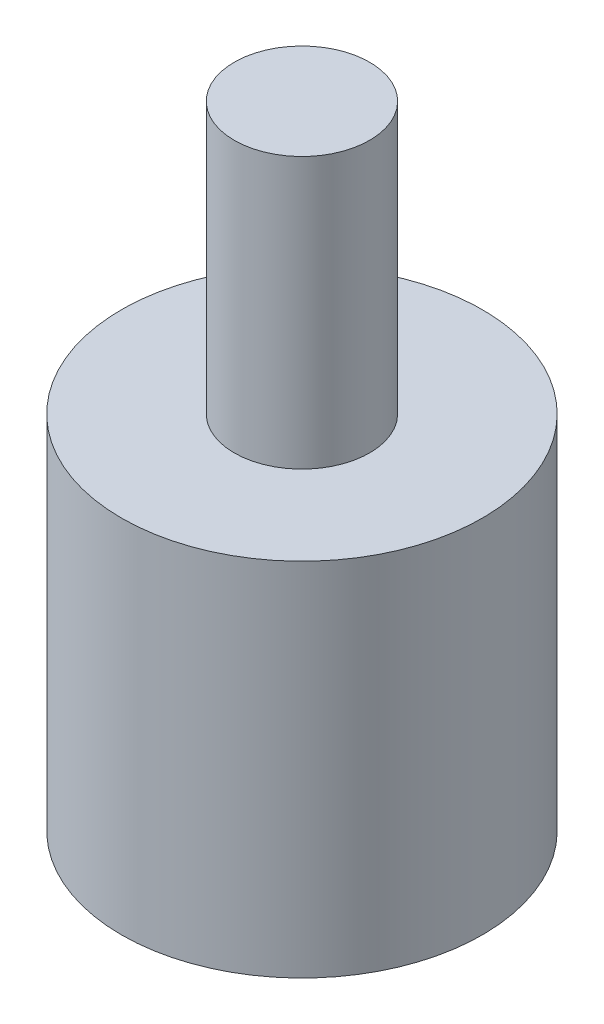
ISO-10303-21;
HEADER;
FILE_DESCRIPTION(('STEP AP214'),'2;1');
FILE_NAME('part.step','',(''),(''),'','','');
FILE_SCHEMA(('AUTOMOTIVE_DESIGN { 1 0 10303 214 1 1 1 1 }'));
ENDSEC;
DATA;
#1=APPLICATION_CONTEXT('core data for automotive mechanical design processes');
#2=APPLICATION_PROTOCOL_DEFINITION('international standard','automotive_design',2000,#1);
#3=PRODUCT_CONTEXT('',#1,'mechanical');
#4=PRODUCT('Part','Part','',(#3));
#5=PRODUCT_RELATED_PRODUCT_CATEGORY('part','',(#4));
#6=PRODUCT_DEFINITION_FORMATION('','',#4);
#7=PRODUCT_DEFINITION_CONTEXT('part definition',#1,'design');
#8=PRODUCT_DEFINITION('design','',#6,#7);
#9=PRODUCT_DEFINITION_SHAPE('','',#8);
#10=(LENGTH_UNIT() NAMED_UNIT(*) SI_UNIT(.MILLI.,.METRE.));
#11=(NAMED_UNIT(*) PLANE_ANGLE_UNIT() SI_UNIT($,.RADIAN.));
#12=(NAMED_UNIT(*) SI_UNIT($,.STERADIAN.) SOLID_ANGLE_UNIT());
#13=UNCERTAINTY_MEASURE_WITH_UNIT(LENGTH_MEASURE(1.E-05),#10,'distance_accuracy_value','');
#14=(GEOMETRIC_REPRESENTATION_CONTEXT(3) GLOBAL_UNCERTAINTY_ASSIGNED_CONTEXT((#13)) GLOBAL_UNIT_ASSIGNED_CONTEXT((#10,
#11,#12)) REPRESENTATION_CONTEXT('',''));
#15=CARTESIAN_POINT('',(0.,0.,0.));
#16=DIRECTION('',(0.,0.,1.));
#17=DIRECTION('',(1.,0.,0.));
#18=AXIS2_PLACEMENT_3D('',#15,#16,#17);
#19=CARTESIAN_POINT('',(0.,8.,0.));
#20=DIRECTION('',(0.,-1.,0.));
#21=DIRECTION('',(0.,0.,-1.));
#22=AXIS2_PLACEMENT_3D('',#19,#20,#21);
#23=CYLINDRICAL_SURFACE('',#22,1.5);
#24=CARTESIAN_POINT('',(0.,0.,0.));
#25=DIRECTION('',(0.,1.,0.));
#26=DIRECTION('',(0.,0.,1.));
#27=AXIS2_PLACEMENT_3D('',#24,#25,#26);
#28=CIRCLE('',#27,1.5);
#29=CARTESIAN_POINT('',(0.,0.,1.5));
#30=VERTEX_POINT('',#29);
#31=EDGE_CURVE('E71',#30,#30,#28,.T.);
#32=ORIENTED_EDGE('',*,*,#31,.F.);
#33=EDGE_LOOP('',(#32));
#34=FACE_BOUND('',#33,.T.);
#35=CARTESIAN_POINT('',(0.,3.,0.));
#36=DIRECTION('',(0.,1.,0.));
#37=DIRECTION('',(0.,0.,1.));
#38=AXIS2_PLACEMENT_3D('',#35,#36,#37);
#39=CIRCLE('',#38,1.5);
#40=CARTESIAN_POINT('',(0.,3.,1.5));
#41=VERTEX_POINT('',#40);
#42=EDGE_CURVE('E67',#41,#41,#39,.T.);
#43=ORIENTED_EDGE('',*,*,#42,.T.);
#44=EDGE_LOOP('',(#43));
#45=FACE_BOUND('',#44,.T.);
#46=ADVANCED_FACE('F49',(#34,#45),#23,.F.);
#47=CARTESIAN_POINT('',(0.,8.,0.));
#48=DIRECTION('',(0.,1.,0.));
#49=DIRECTION('',(0.,0.,1.));
#50=AXIS2_PLACEMENT_3D('',#47,#48,#49);
#51=PLANE('',#50);
#52=CARTESIAN_POINT('',(0.,8.,0.));
#53=DIRECTION('',(0.,1.,0.));
#54=DIRECTION('',(0.,0.,1.));
#55=AXIS2_PLACEMENT_3D('',#52,#53,#54);
#56=CIRCLE('',#55,1.5);
#57=CARTESIAN_POINT('',(0.,8.,1.5));
#58=VERTEX_POINT('',#57);
#59=EDGE_CURVE('E10',#58,#58,#56,.T.);
#60=ORIENTED_EDGE('',*,*,#59,.F.);
#61=EDGE_LOOP('',(#60));
#62=FACE_BOUND('',#61,.T.);
#63=CARTESIAN_POINT('',(0.,8.,0.));
#64=DIRECTION('',(0.,1.,0.));
#65=DIRECTION('',(0.,0.,1.));
#66=AXIS2_PLACEMENT_3D('',#63,#64,#65);
#67=CIRCLE('',#66,4.);
#68=CARTESIAN_POINT('',(0.,8.,4.));
#69=VERTEX_POINT('',#68);
#70=EDGE_CURVE('E58',#69,#69,#67,.T.);
#71=ORIENTED_EDGE('',*,*,#70,.T.);
#72=EDGE_LOOP('',(#71));
#73=FACE_BOUND('',#72,.T.);
#74=ADVANCED_FACE('F83',(#62,#73),#51,.T.);
#75=CARTESIAN_POINT('',(0.,0.,0.));
#76=DIRECTION('',(0.,1.,0.));
#77=DIRECTION('',(0.,0.,1.));
#78=AXIS2_PLACEMENT_3D('',#75,#76,#77);
#79=PLANE('',#78);
#80=CARTESIAN_POINT('',(0.,0.,0.));
#81=DIRECTION('',(0.,1.,0.));
#82=DIRECTION('',(0.,0.,1.));
#83=AXIS2_PLACEMENT_3D('',#80,#81,#82);
#84=CIRCLE('',#83,4.);
#85=CARTESIAN_POINT('',(0.,0.,4.));
#86=VERTEX_POINT('',#85);
#87=EDGE_CURVE('E53',#86,#86,#84,.T.);
#88=ORIENTED_EDGE('',*,*,#87,.F.);
#89=EDGE_LOOP('',(#88));
#90=FACE_BOUND('',#89,.T.);
#91=ORIENTED_EDGE('',*,*,#31,.T.);
#92=EDGE_LOOP('',(#91));
#93=FACE_BOUND('',#92,.T.);
#94=ADVANCED_FACE('F81',(#90,#93),#79,.F.);
#95=CARTESIAN_POINT('',(0.,8.,0.));
#96=DIRECTION('',(0.,-1.,0.));
#97=DIRECTION('',(0.,0.,-1.));
#98=AXIS2_PLACEMENT_3D('',#95,#96,#97);
#99=CYLINDRICAL_SURFACE('',#98,4.);
#100=ORIENTED_EDGE('',*,*,#70,.F.);
#101=EDGE_LOOP('',(#100));
#102=FACE_BOUND('',#101,.T.);
#103=ORIENTED_EDGE('',*,*,#87,.T.);
#104=EDGE_LOOP('',(#103));
#105=FACE_BOUND('',#104,.T.);
#106=ADVANCED_FACE('F51',(#102,#105),#99,.T.);
#107=CARTESIAN_POINT('',(0.,3.,0.));
#108=DIRECTION('',(0.,1.,0.));
#109=DIRECTION('',(0.,0.,1.));
#110=AXIS2_PLACEMENT_3D('',#107,#108,#109);
#111=PLANE('',#110);
#112=ORIENTED_EDGE('',*,*,#42,.F.);
#113=EDGE_LOOP('',(#112));
#114=FACE_BOUND('',#113,.T.);
#115=ADVANCED_FACE('F87',(#114),#111,.F.);
#116=CARTESIAN_POINT('',(0.,14.,0.));
#117=DIRECTION('',(0.,-1.,0.));
#118=DIRECTION('',(0.,0.,-1.));
#119=AXIS2_PLACEMENT_3D('',#116,#117,#118);
#120=CYLINDRICAL_SURFACE('',#119,1.5);
#121=CARTESIAN_POINT('',(0.,14.,0.));
#122=DIRECTION('',(0.,1.,0.));
#123=DIRECTION('',(0.,0.,1.));
#124=AXIS2_PLACEMENT_3D('',#121,#122,#123);
#125=CIRCLE('',#124,1.5);
#126=CARTESIAN_POINT('',(0.,14.,1.5));
#127=VERTEX_POINT('',#126);
#128=EDGE_CURVE('E66',#127,#127,#125,.T.);
#129=ORIENTED_EDGE('',*,*,#128,.F.);
#130=EDGE_LOOP('',(#129));
#131=FACE_BOUND('',#130,.T.);
#132=ORIENTED_EDGE('',*,*,#59,.T.);
#133=EDGE_LOOP('',(#132));
#134=FACE_BOUND('',#133,.T.);
#135=ADVANCED_FACE('F101',(#131,#134),#120,.T.);
#136=CARTESIAN_POINT('',(0.,14.,0.));
#137=DIRECTION('',(0.,1.,0.));
#138=DIRECTION('',(0.,0.,1.));
#139=AXIS2_PLACEMENT_3D('',#136,#137,#138);
#140=PLANE('',#139);
#141=ORIENTED_EDGE('',*,*,#128,.T.);
#142=EDGE_LOOP('',(#141));
#143=FACE_BOUND('',#142,.T.);
#144=ADVANCED_FACE('F105',(#143),#140,.T.);
#145=CLOSED_SHELL('',(#46,#74,#94,#106,#115,#135,#144));
#146=MANIFOLD_SOLID_BREP('B2',#145);
#147=ADVANCED_BREP_SHAPE_REPRESENTATION('',(#18,#146),#14);
#148=SHAPE_DEFINITION_REPRESENTATION(#9,#147);
ENDSEC;
END-ISO-10303-21;
